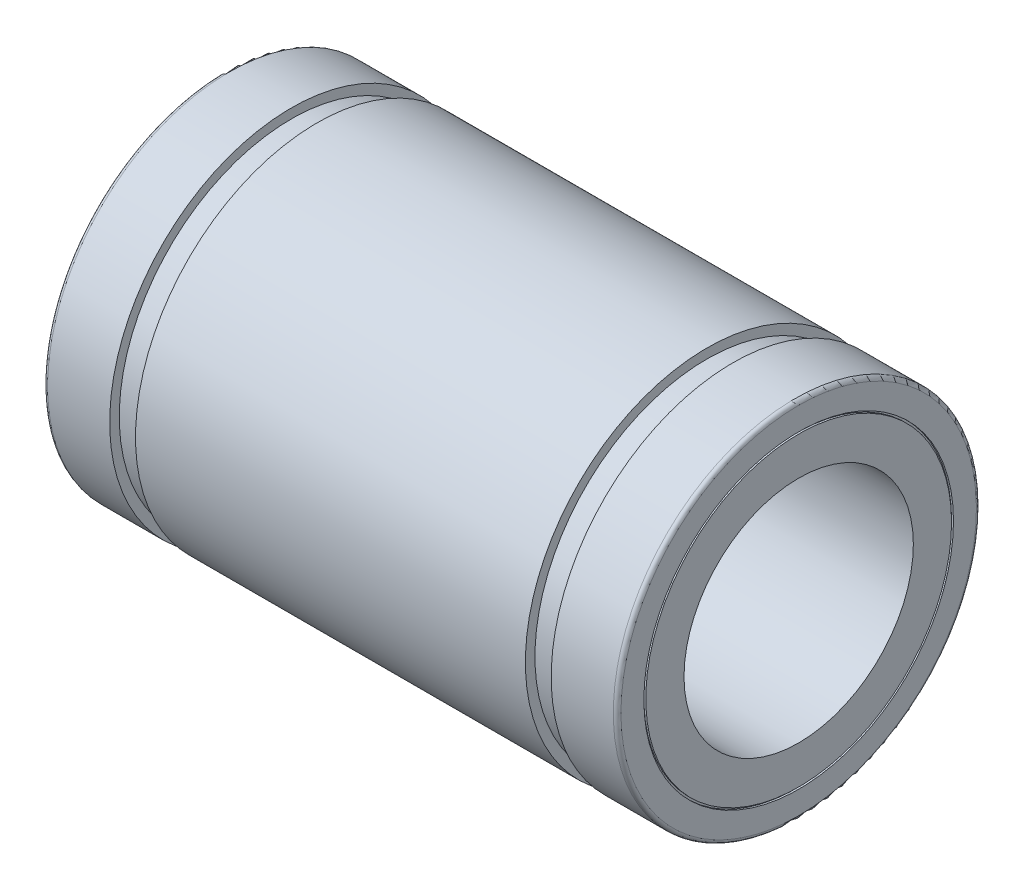
ISO-10303-21;
HEADER;
FILE_DESCRIPTION(('STEP AP214'),'2;1');
FILE_NAME('part.step','',(''),(''),'','','');
FILE_SCHEMA(('AUTOMOTIVE_DESIGN { 1 0 10303 214 1 1 1 1 }'));
ENDSEC;
DATA;
#1=APPLICATION_CONTEXT('core data for automotive mechanical design processes');
#2=APPLICATION_PROTOCOL_DEFINITION('international standard','automotive_design',2000,#1);
#3=PRODUCT_CONTEXT('',#1,'mechanical');
#4=PRODUCT('Part','Part','',(#3));
#5=PRODUCT_RELATED_PRODUCT_CATEGORY('part','',(#4));
#6=PRODUCT_DEFINITION_FORMATION('','',#4);
#7=PRODUCT_DEFINITION_CONTEXT('part definition',#1,'design');
#8=PRODUCT_DEFINITION('design','',#6,#7);
#9=PRODUCT_DEFINITION_SHAPE('','',#8);
#10=(LENGTH_UNIT() NAMED_UNIT(*) SI_UNIT(.MILLI.,.METRE.));
#11=(NAMED_UNIT(*) PLANE_ANGLE_UNIT() SI_UNIT($,.RADIAN.));
#12=(NAMED_UNIT(*) SI_UNIT($,.STERADIAN.) SOLID_ANGLE_UNIT());
#13=UNCERTAINTY_MEASURE_WITH_UNIT(LENGTH_MEASURE(1.E-05),#10,'distance_accuracy_value','');
#14=(GEOMETRIC_REPRESENTATION_CONTEXT(3) GLOBAL_UNCERTAINTY_ASSIGNED_CONTEXT((#13)) GLOBAL_UNIT_ASSIGNED_CONTEXT((#10,
#11,#12)) REPRESENTATION_CONTEXT('',''));
#15=CARTESIAN_POINT('',(0.,0.,0.));
#16=DIRECTION('',(0.,0.,1.));
#17=DIRECTION('',(1.,0.,0.));
#18=AXIS2_PLACEMENT_3D('',#15,#16,#17);
#19=CARTESIAN_POINT('',(0.,0.,0.));
#20=DIRECTION('',(1.,0.,0.));
#21=DIRECTION('',(0.,0.,-1.));
#22=AXIS2_PLACEMENT_3D('',#19,#20,#21);
#23=CYLINDRICAL_SURFACE('',#22,6.);
#24=CARTESIAN_POINT('',(15.,0.,0.));
#25=DIRECTION('',(1.,0.,0.));
#26=DIRECTION('',(0.,0.,-1.));
#27=AXIS2_PLACEMENT_3D('',#24,#25,#26);
#28=CIRCLE('',#27,6.);
#29=CARTESIAN_POINT('',(15.,0.,-6.));
#30=VERTEX_POINT('',#29);
#31=EDGE_CURVE('E180',#30,#30,#28,.F.);
#32=ORIENTED_EDGE('',*,*,#31,.F.);
#33=EDGE_LOOP('',(#32));
#34=FACE_BOUND('',#33,.T.);
#35=CARTESIAN_POINT('',(-15.,0.,0.));
#36=DIRECTION('',(1.,0.,0.));
#37=DIRECTION('',(0.,0.,-1.));
#38=AXIS2_PLACEMENT_3D('',#35,#36,#37);
#39=CIRCLE('',#38,6.);
#40=CARTESIAN_POINT('',(-15.,0.,-6.));
#41=VERTEX_POINT('',#40);
#42=EDGE_CURVE('E183',#41,#41,#39,.T.);
#43=ORIENTED_EDGE('',*,*,#42,.F.);
#44=EDGE_LOOP('',(#43));
#45=FACE_BOUND('',#44,.T.);
#46=ADVANCED_FACE('F15',(#34,#45),#23,.F.);
#47=CARTESIAN_POINT('',(15.,7.,0.));
#48=DIRECTION('',(1.,0.,0.));
#49=DIRECTION('',(0.,0.,-1.));
#50=AXIS2_PLACEMENT_3D('',#47,#48,#49);
#51=PLANE('',#50);
#52=ORIENTED_EDGE('',*,*,#31,.T.);
#53=EDGE_LOOP('',(#52));
#54=FACE_BOUND('',#53,.T.);
#55=CARTESIAN_POINT('',(15.,0.,0.));
#56=DIRECTION('',(1.,0.,0.));
#57=DIRECTION('',(0.,0.,-1.));
#58=AXIS2_PLACEMENT_3D('',#55,#56,#57);
#59=CIRCLE('',#58,8.);
#60=CARTESIAN_POINT('',(15.,0.,-8.));
#61=VERTEX_POINT('',#60);
#62=EDGE_CURVE('E186',#61,#61,#59,.F.);
#63=ORIENTED_EDGE('',*,*,#62,.F.);
#64=EDGE_LOOP('',(#63));
#65=FACE_BOUND('',#64,.T.);
#66=ADVANCED_FACE('F420',(#54,#65),#51,.T.);
#67=CARTESIAN_POINT('',(-15.,7.,0.));
#68=DIRECTION('',(-1.,0.,0.));
#69=DIRECTION('',(0.,0.,1.));
#70=AXIS2_PLACEMENT_3D('',#67,#68,#69);
#71=PLANE('',#70);
#72=CARTESIAN_POINT('',(-15.,0.,0.));
#73=DIRECTION('',(1.,0.,0.));
#74=DIRECTION('',(0.,0.,-1.));
#75=AXIS2_PLACEMENT_3D('',#72,#73,#74);
#76=CIRCLE('',#75,8.);
#77=CARTESIAN_POINT('',(-15.,0.,-8.));
#78=VERTEX_POINT('',#77);
#79=EDGE_CURVE('E189',#78,#78,#76,.T.);
#80=ORIENTED_EDGE('',*,*,#79,.F.);
#81=EDGE_LOOP('',(#80));
#82=FACE_BOUND('',#81,.T.);
#83=ORIENTED_EDGE('',*,*,#42,.T.);
#84=EDGE_LOOP('',(#83));
#85=FACE_BOUND('',#84,.T.);
#86=ADVANCED_FACE('F410',(#82,#85),#71,.T.);
#87=CARTESIAN_POINT('',(0.,0.,0.));
#88=DIRECTION('',(1.,0.,0.));
#89=DIRECTION('',(0.,0.,-1.));
#90=AXIS2_PLACEMENT_3D('',#87,#88,#89);
#91=CYLINDRICAL_SURFACE('',#90,8.);
#92=CARTESIAN_POINT('',(14.9,0.,0.));
#93=DIRECTION('',(1.,0.,0.));
#94=DIRECTION('',(0.,0.,-1.));
#95=AXIS2_PLACEMENT_3D('',#92,#93,#94);
#96=CIRCLE('',#95,8.);
#97=CARTESIAN_POINT('',(14.9,0.,-8.));
#98=VERTEX_POINT('',#97);
#99=EDGE_CURVE('E192',#98,#98,#96,.F.);
#100=ORIENTED_EDGE('',*,*,#99,.F.);
#101=EDGE_LOOP('',(#100));
#102=FACE_BOUND('',#101,.T.);
#103=ORIENTED_EDGE('',*,*,#62,.T.);
#104=EDGE_LOOP('',(#103));
#105=FACE_BOUND('',#104,.T.);
#106=ADVANCED_FACE('F400',(#102,#105),#91,.T.);
#107=CARTESIAN_POINT('',(0.,0.,0.));
#108=DIRECTION('',(1.,0.,0.));
#109=DIRECTION('',(0.,0.,-1.));
#110=AXIS2_PLACEMENT_3D('',#107,#108,#109);
#111=CYLINDRICAL_SURFACE('',#110,8.);
#112=ORIENTED_EDGE('',*,*,#79,.T.);
#113=EDGE_LOOP('',(#112));
#114=FACE_BOUND('',#113,.T.);
#115=CARTESIAN_POINT('',(-14.9,0.,0.));
#116=DIRECTION('',(1.,0.,0.));
#117=DIRECTION('',(0.,0.,-1.));
#118=AXIS2_PLACEMENT_3D('',#115,#116,#117);
#119=CIRCLE('',#118,8.);
#120=CARTESIAN_POINT('',(-14.9,0.,-8.));
#121=VERTEX_POINT('',#120);
#122=EDGE_CURVE('E195',#121,#121,#119,.T.);
#123=ORIENTED_EDGE('',*,*,#122,.F.);
#124=EDGE_LOOP('',(#123));
#125=FACE_BOUND('',#124,.T.);
#126=ADVANCED_FACE('F390',(#114,#125),#111,.T.);
#127=CARTESIAN_POINT('',(14.9,8.05,0.));
#128=DIRECTION('',(1.,0.,0.));
#129=DIRECTION('',(0.,0.,-1.));
#130=AXIS2_PLACEMENT_3D('',#127,#128,#129);
#131=PLANE('',#130);
#132=ORIENTED_EDGE('',*,*,#99,.T.);
#133=EDGE_LOOP('',(#132));
#134=FACE_BOUND('',#133,.T.);
#135=CARTESIAN_POINT('',(14.9,0.,0.));
#136=DIRECTION('',(1.,0.,0.));
#137=DIRECTION('',(0.,0.,-1.));
#138=AXIS2_PLACEMENT_3D('',#135,#136,#137);
#139=CIRCLE('',#138,8.1);
#140=CARTESIAN_POINT('',(14.9,0.,-8.1));
#141=VERTEX_POINT('',#140);
#142=EDGE_CURVE('E198',#141,#141,#139,.T.);
#143=ORIENTED_EDGE('',*,*,#142,.T.);
#144=EDGE_LOOP('',(#143));
#145=FACE_BOUND('',#144,.T.);
#146=ADVANCED_FACE('F380',(#134,#145),#131,.T.);
#147=CARTESIAN_POINT('',(-14.9,8.05,0.));
#148=DIRECTION('',(-1.,0.,0.));
#149=DIRECTION('',(0.,0.,1.));
#150=AXIS2_PLACEMENT_3D('',#147,#148,#149);
#151=PLANE('',#150);
#152=CARTESIAN_POINT('',(-14.9,0.,0.));
#153=DIRECTION('',(1.,0.,0.));
#154=DIRECTION('',(0.,0.,-1.));
#155=AXIS2_PLACEMENT_3D('',#152,#153,#154);
#156=CIRCLE('',#155,8.1);
#157=CARTESIAN_POINT('',(-14.9,0.,-8.1));
#158=VERTEX_POINT('',#157);
#159=EDGE_CURVE('E201',#158,#158,#156,.F.);
#160=ORIENTED_EDGE('',*,*,#159,.T.);
#161=EDGE_LOOP('',(#160));
#162=FACE_BOUND('',#161,.T.);
#163=ORIENTED_EDGE('',*,*,#122,.T.);
#164=EDGE_LOOP('',(#163));
#165=FACE_BOUND('',#164,.T.);
#166=ADVANCED_FACE('F371',(#162,#165),#151,.T.);
#167=CARTESIAN_POINT('',(14.95,0.,0.));
#168=DIRECTION('',(1.,0.,0.));
#169=DIRECTION('',(0.,0.,-1.));
#170=AXIS2_PLACEMENT_3D('',#167,#168,#169);
#171=CYLINDRICAL_SURFACE('',#170,8.1);
#172=CARTESIAN_POINT('',(15.,0.,0.));
#173=DIRECTION('',(1.,0.,0.));
#174=DIRECTION('',(0.,0.,-1.));
#175=AXIS2_PLACEMENT_3D('',#172,#173,#174);
#176=CIRCLE('',#175,8.1);
#177=CARTESIAN_POINT('',(15.,0.,-8.1));
#178=VERTEX_POINT('',#177);
#179=EDGE_CURVE('E204',#178,#178,#176,.F.);
#180=ORIENTED_EDGE('',*,*,#179,.F.);
#181=EDGE_LOOP('',(#180));
#182=FACE_BOUND('',#181,.T.);
#183=ORIENTED_EDGE('',*,*,#142,.F.);
#184=EDGE_LOOP('',(#183));
#185=FACE_BOUND('',#184,.T.);
#186=ADVANCED_FACE('F362',(#182,#185),#171,.F.);
#187=CARTESIAN_POINT('',(-14.95,0.,0.));
#188=DIRECTION('',(1.,0.,0.));
#189=DIRECTION('',(0.,0.,-1.));
#190=AXIS2_PLACEMENT_3D('',#187,#188,#189);
#191=CYLINDRICAL_SURFACE('',#190,8.1);
#192=ORIENTED_EDGE('',*,*,#159,.F.);
#193=EDGE_LOOP('',(#192));
#194=FACE_BOUND('',#193,.T.);
#195=CARTESIAN_POINT('',(-15.,0.,0.));
#196=DIRECTION('',(1.,0.,0.));
#197=DIRECTION('',(0.,0.,-1.));
#198=AXIS2_PLACEMENT_3D('',#195,#196,#197);
#199=CIRCLE('',#198,8.1);
#200=CARTESIAN_POINT('',(-15.,0.,-8.1));
#201=VERTEX_POINT('',#200);
#202=EDGE_CURVE('E61',#201,#201,#199,.T.);
#203=ORIENTED_EDGE('',*,*,#202,.F.);
#204=EDGE_LOOP('',(#203));
#205=FACE_BOUND('',#204,.T.);
#206=ADVANCED_FACE('F84',(#194,#205),#191,.F.);
#207=CARTESIAN_POINT('',(15.,8.7,0.));
#208=DIRECTION('',(1.,0.,0.));
#209=DIRECTION('',(0.,0.,-1.));
#210=AXIS2_PLACEMENT_3D('',#207,#208,#209);
#211=PLANE('',#210);
#212=ORIENTED_EDGE('',*,*,#179,.T.);
#213=EDGE_LOOP('',(#212));
#214=FACE_BOUND('',#213,.T.);
#215=CARTESIAN_POINT('',(15.,0.,0.));
#216=DIRECTION('',(-1.,0.,0.));
#217=DIRECTION('',(0.,0.,1.));
#218=AXIS2_PLACEMENT_3D('',#215,#216,#217);
#219=CIRCLE('',#218,9.3);
#220=CARTESIAN_POINT('',(15.,0.,9.3));
#221=VERTEX_POINT('',#220);
#222=CARTESIAN_POINT('',(15.,9.3,0.));
#223=VERTEX_POINT('',#222);
#224=EDGE_CURVE('E55',#221,#223,#219,.T.);
#225=ORIENTED_EDGE('',*,*,#224,.F.);
#226=CARTESIAN_POINT('',(15.,0.,0.));
#227=DIRECTION('',(-1.,0.,0.));
#228=DIRECTION('',(0.,0.,-1.));
#229=AXIS2_PLACEMENT_3D('',#226,#227,#228);
#230=CIRCLE('',#229,9.3);
#231=CARTESIAN_POINT('',(15.,0.,-9.3));
#232=VERTEX_POINT('',#231);
#233=EDGE_CURVE('E51',#232,#221,#230,.T.);
#234=ORIENTED_EDGE('',*,*,#233,.F.);
#235=CARTESIAN_POINT('',(15.,0.,0.));
#236=DIRECTION('',(-1.,0.,0.));
#237=DIRECTION('',(0.,1.,0.));
#238=AXIS2_PLACEMENT_3D('',#235,#236,#237);
#239=CIRCLE('',#238,9.3);
#240=EDGE_CURVE('E57',#223,#232,#239,.T.);
#241=ORIENTED_EDGE('',*,*,#240,.F.);
#242=EDGE_LOOP('',(#225,#234,#241));
#243=FACE_BOUND('',#242,.T.);
#244=ADVANCED_FACE('F64',(#214,#243),#211,.T.);
#245=CARTESIAN_POINT('',(-15.,8.7,0.));
#246=DIRECTION('',(-1.,0.,0.));
#247=DIRECTION('',(0.,0.,1.));
#248=AXIS2_PLACEMENT_3D('',#245,#246,#247);
#249=PLANE('',#248);
#250=CARTESIAN_POINT('',(-15.,0.,0.));
#251=DIRECTION('',(1.,0.,0.));
#252=DIRECTION('',(0.,0.,1.));
#253=AXIS2_PLACEMENT_3D('',#250,#251,#252);
#254=CIRCLE('',#253,9.3);
#255=CARTESIAN_POINT('',(-15.,0.,9.3));
#256=VERTEX_POINT('',#255);
#257=CARTESIAN_POINT('',(-15.,0.,-9.3));
#258=VERTEX_POINT('',#257);
#259=EDGE_CURVE('E123',#256,#258,#254,.T.);
#260=ORIENTED_EDGE('',*,*,#259,.F.);
#261=CARTESIAN_POINT('',(-15.,0.,0.));
#262=DIRECTION('',(1.,0.,0.));
#263=DIRECTION('',(0.,1.,0.));
#264=AXIS2_PLACEMENT_3D('',#261,#262,#263);
#265=CIRCLE('',#264,9.3);
#266=CARTESIAN_POINT('',(-15.,9.3,0.));
#267=VERTEX_POINT('',#266);
#268=EDGE_CURVE('E143',#267,#256,#265,.T.);
#269=ORIENTED_EDGE('',*,*,#268,.F.);
#270=CARTESIAN_POINT('',(-15.,0.,0.));
#271=DIRECTION('',(1.,0.,0.));
#272=DIRECTION('',(0.,0.,-1.));
#273=AXIS2_PLACEMENT_3D('',#270,#271,#272);
#274=CIRCLE('',#273,9.3);
#275=EDGE_CURVE('E35',#258,#267,#274,.T.);
#276=ORIENTED_EDGE('',*,*,#275,.F.);
#277=EDGE_LOOP('',(#260,#269,#276));
#278=FACE_BOUND('',#277,.T.);
#279=ORIENTED_EDGE('',*,*,#202,.T.);
#280=EDGE_LOOP('',(#279));
#281=FACE_BOUND('',#280,.T.);
#282=ADVANCED_FACE('F83',(#278,#281),#249,.T.);
#283=CARTESIAN_POINT('',(14.8,0.,0.));
#284=DIRECTION('',(-1.,0.,0.));
#285=DIRECTION('',(0.,0.,1.));
#286=AXIS2_PLACEMENT_3D('',#283,#284,#285);
#287=TOROIDAL_SURFACE('',#286,9.3,0.199999999999999);
#288=ORIENTED_EDGE('',*,*,#233,.T.);
#289=ORIENTED_EDGE('',*,*,#224,.T.);
#290=ORIENTED_EDGE('',*,*,#240,.T.);
#291=EDGE_LOOP('',(#288,#289,#290));
#292=FACE_BOUND('',#291,.T.);
#293=CARTESIAN_POINT('',(14.8,0.,0.));
#294=DIRECTION('',(1.,0.,0.));
#295=DIRECTION('',(0.,0.,-1.));
#296=AXIS2_PLACEMENT_3D('',#293,#294,#295);
#297=CIRCLE('',#296,9.5);
#298=CARTESIAN_POINT('',(14.8,0.,-9.5));
#299=VERTEX_POINT('',#298);
#300=EDGE_CURVE('E120',#299,#299,#297,.F.);
#301=ORIENTED_EDGE('',*,*,#300,.F.);
#302=EDGE_LOOP('',(#301));
#303=FACE_BOUND('',#302,.T.);
#304=ADVANCED_FACE('F53',(#292,#303),#287,.T.);
#305=CARTESIAN_POINT('',(-14.8,0.,0.));
#306=DIRECTION('',(-1.,0.,0.));
#307=DIRECTION('',(0.,0.,1.));
#308=AXIS2_PLACEMENT_3D('',#305,#306,#307);
#309=TOROIDAL_SURFACE('',#308,9.3,0.199999999999999);
#310=ORIENTED_EDGE('',*,*,#268,.T.);
#311=ORIENTED_EDGE('',*,*,#259,.T.);
#312=ORIENTED_EDGE('',*,*,#275,.T.);
#313=EDGE_LOOP('',(#310,#311,#312));
#314=FACE_BOUND('',#313,.T.);
#315=CARTESIAN_POINT('',(-14.8,0.,0.));
#316=DIRECTION('',(1.,0.,0.));
#317=DIRECTION('',(0.,0.,-1.));
#318=AXIS2_PLACEMENT_3D('',#315,#316,#317);
#319=CIRCLE('',#318,9.5);
#320=CARTESIAN_POINT('',(-14.8,0.,-9.5));
#321=VERTEX_POINT('',#320);
#322=EDGE_CURVE('E122',#321,#321,#319,.T.);
#323=ORIENTED_EDGE('',*,*,#322,.F.);
#324=EDGE_LOOP('',(#323));
#325=FACE_BOUND('',#324,.T.);
#326=ADVANCED_FACE('F110',(#314,#325),#309,.T.);
#327=CARTESIAN_POINT('',(13.175,0.,0.));
#328=DIRECTION('',(1.,0.,0.));
#329=DIRECTION('',(0.,0.,-1.));
#330=AXIS2_PLACEMENT_3D('',#327,#328,#329);
#331=CYLINDRICAL_SURFACE('',#330,9.5);
#332=CARTESIAN_POINT('',(11.55,0.,0.));
#333=DIRECTION('',(1.,0.,0.));
#334=DIRECTION('',(0.,0.,-1.));
#335=AXIS2_PLACEMENT_3D('',#332,#333,#334);
#336=CIRCLE('',#335,9.5);
#337=CARTESIAN_POINT('',(11.55,0.,-9.5));
#338=VERTEX_POINT('',#337);
#339=EDGE_CURVE('E209',#338,#338,#336,.F.);
#340=ORIENTED_EDGE('',*,*,#339,.F.);
#341=EDGE_LOOP('',(#340));
#342=FACE_BOUND('',#341,.T.);
#343=ORIENTED_EDGE('',*,*,#300,.T.);
#344=EDGE_LOOP('',(#343));
#345=FACE_BOUND('',#344,.T.);
#346=ADVANCED_FACE('F318',(#342,#345),#331,.T.);
#347=CARTESIAN_POINT('',(-13.175,0.,0.));
#348=DIRECTION('',(1.,0.,0.));
#349=DIRECTION('',(0.,0.,-1.));
#350=AXIS2_PLACEMENT_3D('',#347,#348,#349);
#351=CYLINDRICAL_SURFACE('',#350,9.5);
#352=ORIENTED_EDGE('',*,*,#322,.T.);
#353=EDGE_LOOP('',(#352));
#354=FACE_BOUND('',#353,.T.);
#355=CARTESIAN_POINT('',(-11.55,0.,0.));
#356=DIRECTION('',(1.,0.,0.));
#357=DIRECTION('',(0.,0.,-1.));
#358=AXIS2_PLACEMENT_3D('',#355,#356,#357);
#359=CIRCLE('',#358,9.5);
#360=CARTESIAN_POINT('',(-11.55,0.,-9.5));
#361=VERTEX_POINT('',#360);
#362=EDGE_CURVE('E212',#361,#361,#359,.T.);
#363=ORIENTED_EDGE('',*,*,#362,.F.);
#364=EDGE_LOOP('',(#363));
#365=FACE_BOUND('',#364,.T.);
#366=ADVANCED_FACE('F308',(#354,#365),#351,.T.);
#367=CARTESIAN_POINT('',(11.55,9.25,0.));
#368=DIRECTION('',(-1.,0.,0.));
#369=DIRECTION('',(0.,0.,1.));
#370=AXIS2_PLACEMENT_3D('',#367,#368,#369);
#371=PLANE('',#370);
#372=ORIENTED_EDGE('',*,*,#339,.T.);
#373=EDGE_LOOP('',(#372));
#374=FACE_BOUND('',#373,.T.);
#375=CARTESIAN_POINT('',(11.55,0.,0.));
#376=DIRECTION('',(1.,0.,0.));
#377=DIRECTION('',(0.,0.,-1.));
#378=AXIS2_PLACEMENT_3D('',#375,#376,#377);
#379=CIRCLE('',#378,9.);
#380=CARTESIAN_POINT('',(11.55,0.,-9.));
#381=VERTEX_POINT('',#380);
#382=EDGE_CURVE('E215',#381,#381,#379,.F.);
#383=ORIENTED_EDGE('',*,*,#382,.F.);
#384=EDGE_LOOP('',(#383));
#385=FACE_BOUND('',#384,.T.);
#386=ADVANCED_FACE('F298',(#374,#385),#371,.T.);
#387=CARTESIAN_POINT('',(-11.55,9.25,0.));
#388=DIRECTION('',(1.,0.,0.));
#389=DIRECTION('',(0.,0.,-1.));
#390=AXIS2_PLACEMENT_3D('',#387,#388,#389);
#391=PLANE('',#390);
#392=CARTESIAN_POINT('',(-11.55,0.,0.));
#393=DIRECTION('',(1.,0.,0.));
#394=DIRECTION('',(0.,0.,-1.));
#395=AXIS2_PLACEMENT_3D('',#392,#393,#394);
#396=CIRCLE('',#395,9.);
#397=CARTESIAN_POINT('',(-11.55,0.,-9.));
#398=VERTEX_POINT('',#397);
#399=EDGE_CURVE('E218',#398,#398,#396,.T.);
#400=ORIENTED_EDGE('',*,*,#399,.F.);
#401=EDGE_LOOP('',(#400));
#402=FACE_BOUND('',#401,.T.);
#403=ORIENTED_EDGE('',*,*,#362,.T.);
#404=EDGE_LOOP('',(#403));
#405=FACE_BOUND('',#404,.T.);
#406=ADVANCED_FACE('F288',(#402,#405),#391,.T.);
#407=CARTESIAN_POINT('',(10.875,0.,0.));
#408=DIRECTION('',(1.,0.,0.));
#409=DIRECTION('',(0.,0.,-1.));
#410=AXIS2_PLACEMENT_3D('',#407,#408,#409);
#411=CYLINDRICAL_SURFACE('',#410,9.);
#412=CARTESIAN_POINT('',(10.2,0.,0.));
#413=DIRECTION('',(1.,0.,0.));
#414=DIRECTION('',(0.,0.,-1.));
#415=AXIS2_PLACEMENT_3D('',#412,#413,#414);
#416=CIRCLE('',#415,9.);
#417=CARTESIAN_POINT('',(10.2,0.,-9.));
#418=VERTEX_POINT('',#417);
#419=EDGE_CURVE('E221',#418,#418,#416,.F.);
#420=ORIENTED_EDGE('',*,*,#419,.F.);
#421=EDGE_LOOP('',(#420));
#422=FACE_BOUND('',#421,.T.);
#423=ORIENTED_EDGE('',*,*,#382,.T.);
#424=EDGE_LOOP('',(#423));
#425=FACE_BOUND('',#424,.T.);
#426=ADVANCED_FACE('F253',(#422,#425),#411,.T.);
#427=CARTESIAN_POINT('',(-10.875,0.,0.));
#428=DIRECTION('',(1.,0.,0.));
#429=DIRECTION('',(0.,0.,-1.));
#430=AXIS2_PLACEMENT_3D('',#427,#428,#429);
#431=CYLINDRICAL_SURFACE('',#430,9.);
#432=ORIENTED_EDGE('',*,*,#399,.T.);
#433=EDGE_LOOP('',(#432));
#434=FACE_BOUND('',#433,.T.);
#435=CARTESIAN_POINT('',(-10.2,0.,0.));
#436=DIRECTION('',(1.,0.,0.));
#437=DIRECTION('',(0.,0.,-1.));
#438=AXIS2_PLACEMENT_3D('',#435,#436,#437);
#439=CIRCLE('',#438,9.);
#440=CARTESIAN_POINT('',(-10.2,0.,-9.));
#441=VERTEX_POINT('',#440);
#442=EDGE_CURVE('E224',#441,#441,#439,.T.);
#443=ORIENTED_EDGE('',*,*,#442,.F.);
#444=EDGE_LOOP('',(#443));
#445=FACE_BOUND('',#444,.T.);
#446=ADVANCED_FACE('F243',(#434,#445),#431,.T.);
#447=CARTESIAN_POINT('',(10.2,9.25,0.));
#448=DIRECTION('',(1.,0.,0.));
#449=DIRECTION('',(0.,0.,-1.));
#450=AXIS2_PLACEMENT_3D('',#447,#448,#449);
#451=PLANE('',#450);
#452=ORIENTED_EDGE('',*,*,#419,.T.);
#453=EDGE_LOOP('',(#452));
#454=FACE_BOUND('',#453,.T.);
#455=CARTESIAN_POINT('',(10.2,0.,0.));
#456=DIRECTION('',(1.,0.,0.));
#457=DIRECTION('',(0.,0.,-1.));
#458=AXIS2_PLACEMENT_3D('',#455,#456,#457);
#459=CIRCLE('',#458,9.5);
#460=CARTESIAN_POINT('',(10.2,0.,-9.5));
#461=VERTEX_POINT('',#460);
#462=EDGE_CURVE('E26',#461,#461,#459,.F.);
#463=ORIENTED_EDGE('',*,*,#462,.F.);
#464=EDGE_LOOP('',(#463));
#465=FACE_BOUND('',#464,.T.);
#466=ADVANCED_FACE('F240',(#454,#465),#451,.T.);
#467=CARTESIAN_POINT('',(-10.2,9.25,0.));
#468=DIRECTION('',(-1.,0.,0.));
#469=DIRECTION('',(0.,0.,1.));
#470=AXIS2_PLACEMENT_3D('',#467,#468,#469);
#471=PLANE('',#470);
#472=CARTESIAN_POINT('',(-10.2,0.,0.));
#473=DIRECTION('',(1.,0.,0.));
#474=DIRECTION('',(0.,0.,-1.));
#475=AXIS2_PLACEMENT_3D('',#472,#473,#474);
#476=CIRCLE('',#475,9.5);
#477=CARTESIAN_POINT('',(-10.2,0.,-9.5));
#478=VERTEX_POINT('',#477);
#479=EDGE_CURVE('E9',#478,#478,#476,.T.);
#480=ORIENTED_EDGE('',*,*,#479,.F.);
#481=EDGE_LOOP('',(#480));
#482=FACE_BOUND('',#481,.T.);
#483=ORIENTED_EDGE('',*,*,#442,.T.);
#484=EDGE_LOOP('',(#483));
#485=FACE_BOUND('',#484,.T.);
#486=ADVANCED_FACE('F242',(#482,#485),#471,.T.);
#487=CARTESIAN_POINT('',(0.,0.,0.));
#488=DIRECTION('',(1.,0.,0.));
#489=DIRECTION('',(0.,0.,-1.));
#490=AXIS2_PLACEMENT_3D('',#487,#488,#489);
#491=CYLINDRICAL_SURFACE('',#490,9.5);
#492=ORIENTED_EDGE('',*,*,#462,.T.);
#493=EDGE_LOOP('',(#492));
#494=FACE_BOUND('',#493,.T.);
#495=ORIENTED_EDGE('',*,*,#479,.T.);
#496=EDGE_LOOP('',(#495));
#497=FACE_BOUND('',#496,.T.);
#498=ADVANCED_FACE('F237',(#494,#497),#491,.T.);
#499=CLOSED_SHELL('',(#46,#66,#86,#106,#126,#146,#166,#186,#206,#244,#282,#304,#326,#346,#366,
#386,#406,#426,#446,#466,#486,#498));
#500=MANIFOLD_SOLID_BREP('B1',#499);
#501=ADVANCED_BREP_SHAPE_REPRESENTATION('',(#18,#500),#14);
#502=SHAPE_DEFINITION_REPRESENTATION(#9,#501);
ENDSEC;
END-ISO-10303-21;
